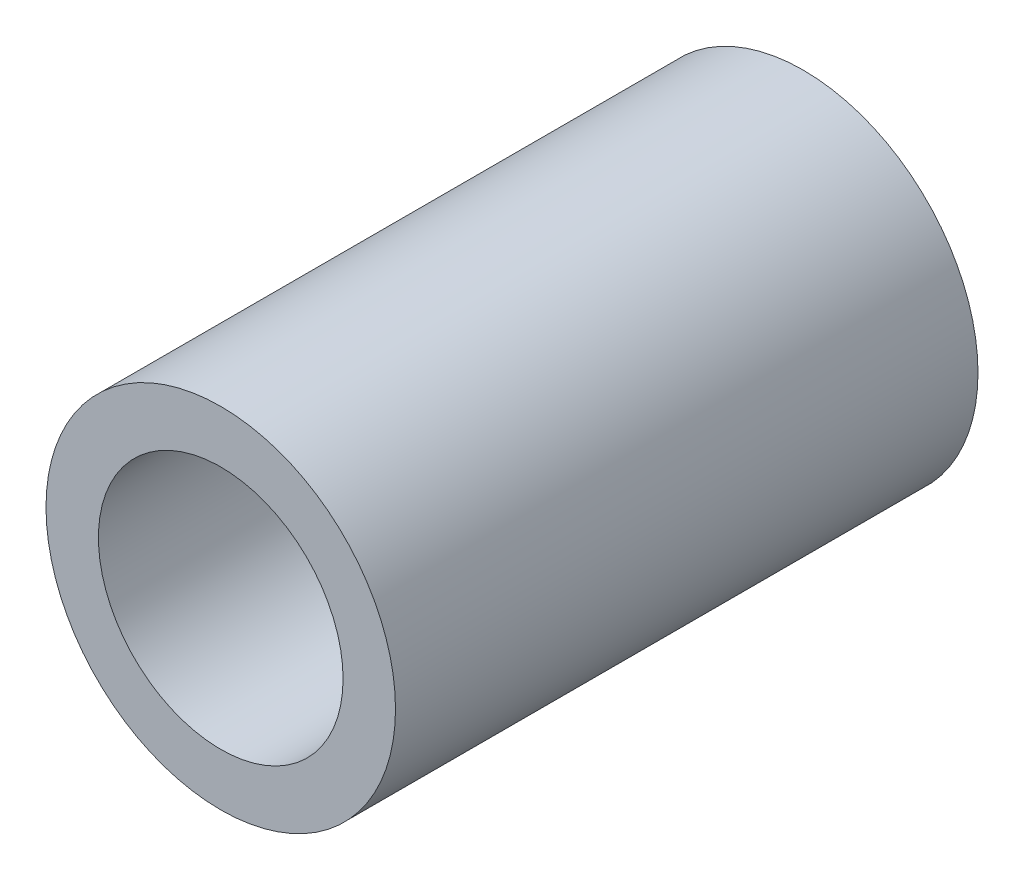
ISO-10303-21;
HEADER;
FILE_DESCRIPTION(('STEP AP214'),'2;1');
FILE_NAME('part.step','',(''),(''),'','','');
FILE_SCHEMA(('AUTOMOTIVE_DESIGN { 1 0 10303 214 1 1 1 1 }'));
ENDSEC;
DATA;
#1=APPLICATION_CONTEXT('core data for automotive mechanical design processes');
#2=APPLICATION_PROTOCOL_DEFINITION('international standard','automotive_design',2000,#1);
#3=PRODUCT_CONTEXT('',#1,'mechanical');
#4=PRODUCT('Part','Part','',(#3));
#5=PRODUCT_RELATED_PRODUCT_CATEGORY('part','',(#4));
#6=PRODUCT_DEFINITION_FORMATION('','',#4);
#7=PRODUCT_DEFINITION_CONTEXT('part definition',#1,'design');
#8=PRODUCT_DEFINITION('design','',#6,#7);
#9=PRODUCT_DEFINITION_SHAPE('','',#8);
#10=(LENGTH_UNIT() NAMED_UNIT(*) SI_UNIT(.MILLI.,.METRE.));
#11=(NAMED_UNIT(*) PLANE_ANGLE_UNIT() SI_UNIT($,.RADIAN.));
#12=(NAMED_UNIT(*) SI_UNIT($,.STERADIAN.) SOLID_ANGLE_UNIT());
#13=UNCERTAINTY_MEASURE_WITH_UNIT(LENGTH_MEASURE(1.E-05),#10,'distance_accuracy_value','');
#14=(GEOMETRIC_REPRESENTATION_CONTEXT(3) GLOBAL_UNCERTAINTY_ASSIGNED_CONTEXT((#13)) GLOBAL_UNIT_ASSIGNED_CONTEXT((#10,
#11,#12)) REPRESENTATION_CONTEXT('',''));
#15=CARTESIAN_POINT('',(0.,0.,0.));
#16=DIRECTION('',(0.,0.,1.));
#17=DIRECTION('',(1.,0.,0.));
#18=AXIS2_PLACEMENT_3D('',#15,#16,#17);
#19=CARTESIAN_POINT('',(0.,0.,5.));
#20=DIRECTION('',(0.,0.,1.));
#21=DIRECTION('',(1.,0.,0.));
#22=AXIS2_PLACEMENT_3D('',#19,#20,#21);
#23=PLANE('',#22);
#24=CARTESIAN_POINT('',(0.,0.,5.));
#25=DIRECTION('',(0.,0.,1.));
#26=DIRECTION('',(1.,0.,0.));
#27=AXIS2_PLACEMENT_3D('',#24,#25,#26);
#28=CIRCLE('',#27,3.);
#29=CARTESIAN_POINT('',(3.,0.,5.));
#30=VERTEX_POINT('',#29);
#31=EDGE_CURVE('E10',#30,#30,#28,.T.);
#32=ORIENTED_EDGE('',*,*,#31,.T.);
#33=EDGE_LOOP('',(#32));
#34=FACE_BOUND('',#33,.T.);
#35=CARTESIAN_POINT('',(0.,0.,5.));
#36=DIRECTION('',(0.,0.,1.));
#37=DIRECTION('',(1.,0.,0.));
#38=AXIS2_PLACEMENT_3D('',#35,#36,#37);
#39=CIRCLE('',#38,2.1);
#40=CARTESIAN_POINT('',(2.1,0.,5.));
#41=VERTEX_POINT('',#40);
#42=EDGE_CURVE('E53',#41,#41,#39,.T.);
#43=ORIENTED_EDGE('',*,*,#42,.F.);
#44=EDGE_LOOP('',(#43));
#45=FACE_BOUND('',#44,.T.);
#46=ADVANCED_FACE('F39',(#34,#45),#23,.T.);
#47=CARTESIAN_POINT('',(0.,0.,-5.));
#48=DIRECTION('',(0.,0.,1.));
#49=DIRECTION('',(1.,0.,0.));
#50=AXIS2_PLACEMENT_3D('',#47,#48,#49);
#51=PLANE('',#50);
#52=CARTESIAN_POINT('',(0.,0.,-5.));
#53=DIRECTION('',(0.,0.,1.));
#54=DIRECTION('',(1.,0.,0.));
#55=AXIS2_PLACEMENT_3D('',#52,#53,#54);
#56=CIRCLE('',#55,3.);
#57=CARTESIAN_POINT('',(3.,0.,-5.));
#58=VERTEX_POINT('',#57);
#59=EDGE_CURVE('E43',#58,#58,#56,.T.);
#60=ORIENTED_EDGE('',*,*,#59,.F.);
#61=EDGE_LOOP('',(#60));
#62=FACE_BOUND('',#61,.T.);
#63=CARTESIAN_POINT('',(0.,0.,-5.));
#64=DIRECTION('',(0.,0.,1.));
#65=DIRECTION('',(1.,0.,0.));
#66=AXIS2_PLACEMENT_3D('',#63,#64,#65);
#67=CIRCLE('',#66,2.1);
#68=CARTESIAN_POINT('',(2.1,0.,-5.));
#69=VERTEX_POINT('',#68);
#70=EDGE_CURVE('E55',#69,#69,#67,.T.);
#71=ORIENTED_EDGE('',*,*,#70,.T.);
#72=EDGE_LOOP('',(#71));
#73=FACE_BOUND('',#72,.T.);
#74=ADVANCED_FACE('F66',(#62,#73),#51,.F.);
#75=CARTESIAN_POINT('',(0.,0.,5.));
#76=DIRECTION('',(0.,0.,-1.));
#77=DIRECTION('',(-1.,0.,0.));
#78=AXIS2_PLACEMENT_3D('',#75,#76,#77);
#79=CYLINDRICAL_SURFACE('',#78,3.);
#80=ORIENTED_EDGE('',*,*,#31,.F.);
#81=EDGE_LOOP('',(#80));
#82=FACE_BOUND('',#81,.T.);
#83=ORIENTED_EDGE('',*,*,#59,.T.);
#84=EDGE_LOOP('',(#83));
#85=FACE_BOUND('',#84,.T.);
#86=ADVANCED_FACE('F41',(#82,#85),#79,.T.);
#87=CARTESIAN_POINT('',(0.,0.,5.));
#88=DIRECTION('',(0.,0.,-1.));
#89=DIRECTION('',(-1.,0.,0.));
#90=AXIS2_PLACEMENT_3D('',#87,#88,#89);
#91=CYLINDRICAL_SURFACE('',#90,2.1);
#92=ORIENTED_EDGE('',*,*,#42,.T.);
#93=EDGE_LOOP('',(#92));
#94=FACE_BOUND('',#93,.T.);
#95=ORIENTED_EDGE('',*,*,#70,.F.);
#96=EDGE_LOOP('',(#95));
#97=FACE_BOUND('',#96,.T.);
#98=ADVANCED_FACE('F62',(#94,#97),#91,.F.);
#99=CLOSED_SHELL('',(#46,#74,#86,#98));
#100=MANIFOLD_SOLID_BREP('B2',#99);
#101=ADVANCED_BREP_SHAPE_REPRESENTATION('',(#18,#100),#14);
#102=SHAPE_DEFINITION_REPRESENTATION(#9,#101);
ENDSEC;
END-ISO-10303-21;
